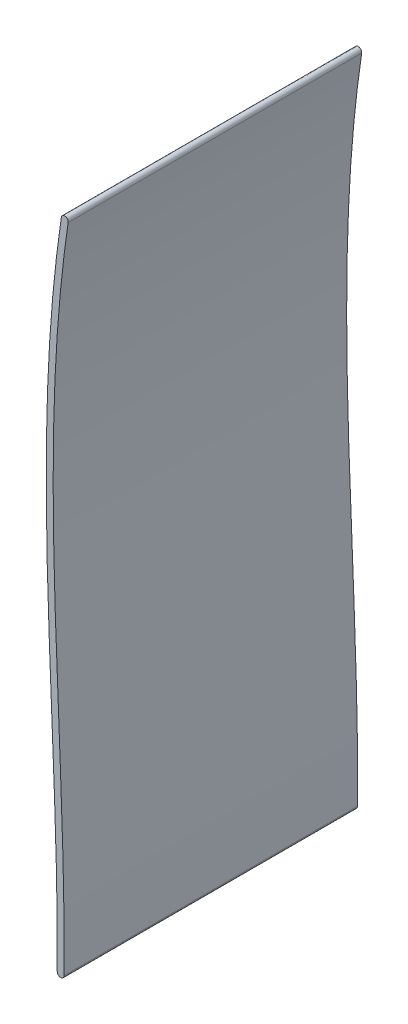
ISO-10303-21;
HEADER;
FILE_DESCRIPTION(('STEP AP214'),'2;1');
FILE_NAME('part.step','',(''),(''),'','','');
FILE_SCHEMA(('AUTOMOTIVE_DESIGN { 1 0 10303 214 1 1 1 1 }'));
ENDSEC;
DATA;
#1=APPLICATION_CONTEXT('core data for automotive mechanical design processes');
#2=APPLICATION_PROTOCOL_DEFINITION('international standard','automotive_design',2000,#1);
#3=PRODUCT_CONTEXT('',#1,'mechanical');
#4=PRODUCT('Part','Part','',(#3));
#5=PRODUCT_RELATED_PRODUCT_CATEGORY('part','',(#4));
#6=PRODUCT_DEFINITION_FORMATION('','',#4);
#7=PRODUCT_DEFINITION_CONTEXT('part definition',#1,'design');
#8=PRODUCT_DEFINITION('design','',#6,#7);
#9=PRODUCT_DEFINITION_SHAPE('','',#8);
#10=(LENGTH_UNIT() NAMED_UNIT(*) SI_UNIT(.MILLI.,.METRE.));
#11=(NAMED_UNIT(*) PLANE_ANGLE_UNIT() SI_UNIT($,.RADIAN.));
#12=(NAMED_UNIT(*) SI_UNIT($,.STERADIAN.) SOLID_ANGLE_UNIT());
#13=UNCERTAINTY_MEASURE_WITH_UNIT(LENGTH_MEASURE(1.E-05),#10,'distance_accuracy_value','');
#14=(GEOMETRIC_REPRESENTATION_CONTEXT(3) GLOBAL_UNCERTAINTY_ASSIGNED_CONTEXT((#13)) GLOBAL_UNIT_ASSIGNED_CONTEXT((#10,
#11,#12)) REPRESENTATION_CONTEXT('',''));
#15=CARTESIAN_POINT('',(0.,0.,0.));
#16=DIRECTION('',(0.,0.,1.));
#17=DIRECTION('',(1.,0.,0.));
#18=AXIS2_PLACEMENT_3D('',#15,#16,#17);
#19=CARTESIAN_POINT('',(1.18215294214931,189.743787991927,85.));
#20=CARTESIAN_POINT('',(-8.16238636995096,126.880135698512,85.));
#21=CARTESIAN_POINT('',(0.457227390005115,63.1064464640167,85.));
#22=CARTESIAN_POINT('',(0.,0.,85.));
#23=B_SPLINE_CURVE_WITH_KNOTS('',3,(#19,#20,#21,#22),.UNSPECIFIED.,.F.,.F.,(4,4),(0.,1.),.UNSPECIFIED.);
#24=DIRECTION('',(0.,0.,-1.));
#25=VECTOR('',#24,1.);
#26=SURFACE_OF_LINEAR_EXTRUSION('',#23,#25);
#27=CARTESIAN_POINT('',(1.18215294214931,189.743787991927,0.));
#28=CARTESIAN_POINT('',(-8.16238636995096,126.880135698512,0.));
#29=CARTESIAN_POINT('',(0.457227390005115,63.1064464640167,0.));
#30=CARTESIAN_POINT('',(0.,0.,0.));
#31=B_SPLINE_CURVE_WITH_KNOTS('',3,(#27,#28,#29,#30),.UNSPECIFIED.,.F.,.F.,(4,4),(0.,1.),.UNSPECIFIED.);
#32=CARTESIAN_POINT('',(1.18215294214931,189.743787991927,0.));
#33=VERTEX_POINT('',#32);
#34=CARTESIAN_POINT('',(0.,0.,0.));
#35=VERTEX_POINT('',#34);
#36=EDGE_CURVE('E124',#33,#35,#31,.T.);
#37=ORIENTED_EDGE('',*,*,#36,.T.);
#38=DIRECTION('',(0.,0.,-1.));
#39=VECTOR('',#38,1.);
#40=CARTESIAN_POINT('',(0.,0.,85.));
#41=LINE('',#40,#39);
#42=CARTESIAN_POINT('',(0.,0.,85.));
#43=VERTEX_POINT('',#42);
#44=EDGE_CURVE('E11',#43,#35,#41,.T.);
#45=ORIENTED_EDGE('',*,*,#44,.F.);
#46=CARTESIAN_POINT('',(1.18215294214931,189.743787991927,85.));
#47=VERTEX_POINT('',#46);
#48=EDGE_CURVE('E93',#47,#43,#23,.T.);
#49=ORIENTED_EDGE('',*,*,#48,.F.);
#50=DIRECTION('',(0.,0.,-1.));
#51=VECTOR('',#50,1.);
#52=CARTESIAN_POINT('',(1.18215294214931,189.743787991927,85.));
#53=LINE('',#52,#51);
#54=EDGE_CURVE('E101',#47,#33,#53,.T.);
#55=ORIENTED_EDGE('',*,*,#54,.T.);
#56=EDGE_LOOP('',(#37,#45,#49,#55));
#57=FACE_BOUND('',#56,.T.);
#58=ADVANCED_FACE('F41',(#57),#26,.F.);
#59=CARTESIAN_POINT('',(0.999973753588583,-0.00724514554448299,85.));
#60=DIRECTION('',(0.,0.,-1.));
#61=DIRECTION('',(-1.,0.,0.));
#62=AXIS2_PLACEMENT_3D('',#59,#60,#61);
#63=CYLINDRICAL_SURFACE('',#62,1.);
#64=CARTESIAN_POINT('',(0.999973753588583,-0.00724514554448299,0.));
#65=DIRECTION('',(0.,0.,1.));
#66=DIRECTION('',(1.,0.,0.));
#67=AXIS2_PLACEMENT_3D('',#64,#65,#66);
#68=CIRCLE('',#67,1.);
#69=CARTESIAN_POINT('',(1.99994750717717,-0.014490291088966,0.));
#70=VERTEX_POINT('',#69);
#71=EDGE_CURVE('E97',#35,#70,#68,.T.);
#72=ORIENTED_EDGE('',*,*,#71,.T.);
#73=DIRECTION('',(0.,0.,-1.));
#74=VECTOR('',#73,1.);
#75=CARTESIAN_POINT('',(1.99994750717717,-0.014490291088966,85.));
#76=LINE('',#75,#74);
#77=CARTESIAN_POINT('',(1.99994750717717,-0.014490291088966,85.));
#78=VERTEX_POINT('',#77);
#79=EDGE_CURVE('E50',#78,#70,#76,.T.);
#80=ORIENTED_EDGE('',*,*,#79,.F.);
#81=CARTESIAN_POINT('',(0.999973753588583,-0.00724514554448299,85.));
#82=DIRECTION('',(0.,0.,1.));
#83=DIRECTION('',(1.,0.,0.));
#84=AXIS2_PLACEMENT_3D('',#81,#82,#83);
#85=CIRCLE('',#84,1.);
#86=EDGE_CURVE('E88',#43,#78,#85,.T.);
#87=ORIENTED_EDGE('',*,*,#86,.F.);
#88=ORIENTED_EDGE('',*,*,#44,.T.);
#89=EDGE_LOOP('',(#72,#80,#87,#88));
#90=FACE_BOUND('',#89,.T.);
#91=ADVANCED_FACE('F96',(#90),#63,.T.);
#92=CARTESIAN_POINT('',(1.99994750717717,-0.014490291088966,85.));
#93=CARTESIAN_POINT('',(2.11473352578899,15.8282564399489,85.));
#94=CARTESIAN_POINT('',(1.20610199175561,47.498374342575,85.));
#95=CARTESIAN_POINT('',(-1.02082826519518,95.0477680275821,85.));
#96=CARTESIAN_POINT('',(-1.48509019546275,134.541376244731,85.));
#97=CARTESIAN_POINT('',(0.232703186082286,165.971459224795,85.));
#98=CARTESIAN_POINT('',(2.00176233638798,181.655093927438,85.));
#99=CARTESIAN_POINT('',(3.16041635905259,189.449723622541,85.));
#100=B_SPLINE_CURVE_WITH_KNOTS('',3,(#92,#93,#94,#95,#96,#97,#98,#99),.UNSPECIFIED.,.F.,.F.,(4,
1,1,1,1,4),(0.,0.25,0.5,0.75,0.875,1.),.UNSPECIFIED.);
#101=DIRECTION('',(0.,0.,-1.));
#102=VECTOR('',#101,1.);
#103=SURFACE_OF_LINEAR_EXTRUSION('',#100,#102);
#104=CARTESIAN_POINT('',(1.99994750717717,-0.014490291088966,0.));
#105=CARTESIAN_POINT('',(2.11473352578899,15.8282564399489,0.));
#106=CARTESIAN_POINT('',(1.20610199175561,47.498374342575,0.));
#107=CARTESIAN_POINT('',(-1.02082826519518,95.0477680275821,0.));
#108=CARTESIAN_POINT('',(-1.48509019546275,134.541376244731,0.));
#109=CARTESIAN_POINT('',(0.232703186082286,165.971459224795,0.));
#110=CARTESIAN_POINT('',(2.00176233638798,181.655093927438,0.));
#111=CARTESIAN_POINT('',(3.16041635905259,189.449723622541,0.));
#112=B_SPLINE_CURVE_WITH_KNOTS('',3,(#104,#105,#106,#107,#108,#109,#110,#111),.UNSPECIFIED.,.F.,
.F.,(4,1,1,1,1,4),(0.,0.25,0.5,0.75,0.875,1.),.UNSPECIFIED.);
#113=CARTESIAN_POINT('',(3.16041635905259,189.449723622541,0.));
#114=VERTEX_POINT('',#113);
#115=EDGE_CURVE('E75',#70,#114,#112,.T.);
#116=ORIENTED_EDGE('',*,*,#115,.T.);
#117=DIRECTION('',(0.,0.,-1.));
#118=VECTOR('',#117,1.);
#119=CARTESIAN_POINT('',(3.16041635905259,189.449723622541,85.));
#120=LINE('',#119,#118);
#121=CARTESIAN_POINT('',(3.16041635905259,189.449723622541,85.));
#122=VERTEX_POINT('',#121);
#123=EDGE_CURVE('E98',#122,#114,#120,.T.);
#124=ORIENTED_EDGE('',*,*,#123,.F.);
#125=EDGE_CURVE('E91',#78,#122,#100,.T.);
#126=ORIENTED_EDGE('',*,*,#125,.F.);
#127=ORIENTED_EDGE('',*,*,#79,.T.);
#128=EDGE_LOOP('',(#116,#124,#126,#127));
#129=FACE_BOUND('',#128,.T.);
#130=ADVANCED_FACE('F99',(#129),#103,.F.);
#131=CARTESIAN_POINT('',(2.17128465060095,189.596755807234,85.));
#132=DIRECTION('',(0.,0.,-1.));
#133=DIRECTION('',(-1.,0.,0.));
#134=AXIS2_PLACEMENT_3D('',#131,#132,#133);
#135=CYLINDRICAL_SURFACE('',#134,1.);
#136=CARTESIAN_POINT('',(2.17128465060095,189.596755807234,0.));
#137=DIRECTION('',(0.,0.,1.));
#138=DIRECTION('',(-1.,0.,0.));
#139=AXIS2_PLACEMENT_3D('',#136,#137,#138);
#140=CIRCLE('',#139,1.);
#141=EDGE_CURVE('E81',#114,#33,#140,.T.);
#142=ORIENTED_EDGE('',*,*,#141,.T.);
#143=ORIENTED_EDGE('',*,*,#54,.F.);
#144=CARTESIAN_POINT('',(2.17128465060095,189.596755807234,85.));
#145=DIRECTION('',(0.,0.,1.));
#146=DIRECTION('',(-1.,0.,0.));
#147=AXIS2_PLACEMENT_3D('',#144,#145,#146);
#148=CIRCLE('',#147,1.);
#149=EDGE_CURVE('E58',#122,#47,#148,.T.);
#150=ORIENTED_EDGE('',*,*,#149,.F.);
#151=ORIENTED_EDGE('',*,*,#123,.T.);
#152=EDGE_LOOP('',(#142,#143,#150,#151));
#153=FACE_BOUND('',#152,.T.);
#154=ADVANCED_FACE('F113',(#153),#135,.T.);
#155=CARTESIAN_POINT('',(-2.74166549971103,94.9629418099391,85.));
#156=DIRECTION('',(0.,0.,-1.));
#157=DIRECTION('',(-1.,0.,0.));
#158=AXIS2_PLACEMENT_3D('',#155,#156,#157);
#159=PLANE('',#158);
#160=ORIENTED_EDGE('',*,*,#48,.T.);
#161=ORIENTED_EDGE('',*,*,#86,.T.);
#162=ORIENTED_EDGE('',*,*,#125,.T.);
#163=ORIENTED_EDGE('',*,*,#149,.T.);
#164=EDGE_LOOP('',(#160,#161,#162,#163));
#165=FACE_BOUND('',#164,.T.);
#166=ADVANCED_FACE('F89',(#165),#159,.F.);
#167=CARTESIAN_POINT('',(-2.74166549971103,94.9629418099391,0.));
#168=DIRECTION('',(0.,0.,-1.));
#169=DIRECTION('',(-1.,0.,0.));
#170=AXIS2_PLACEMENT_3D('',#167,#168,#169);
#171=PLANE('',#170);
#172=ORIENTED_EDGE('',*,*,#36,.F.);
#173=ORIENTED_EDGE('',*,*,#141,.F.);
#174=ORIENTED_EDGE('',*,*,#115,.F.);
#175=ORIENTED_EDGE('',*,*,#71,.F.);
#176=EDGE_LOOP('',(#172,#173,#174,#175));
#177=FACE_BOUND('',#176,.T.);
#178=ADVANCED_FACE('F141',(#177),#171,.T.);
#179=CLOSED_SHELL('',(#58,#91,#130,#154,#166,#178));
#180=MANIFOLD_SOLID_BREP('B2',#179);
#181=ADVANCED_BREP_SHAPE_REPRESENTATION('',(#18,#180),#14);
#182=SHAPE_DEFINITION_REPRESENTATION(#9,#181);
ENDSEC;
END-ISO-10303-21;
